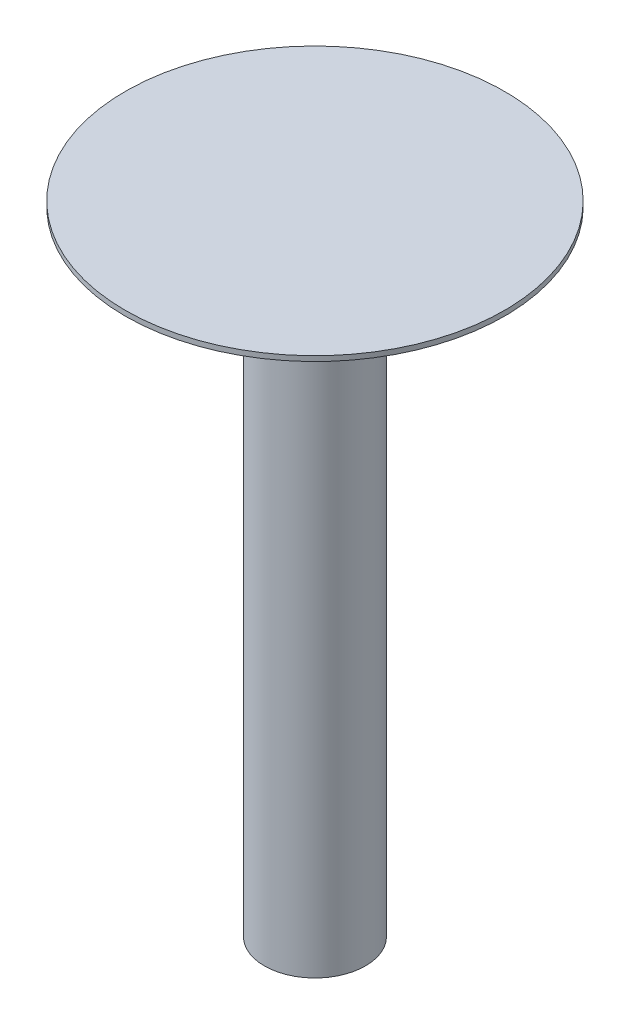
ISO-10303-21;
HEADER;
FILE_DESCRIPTION(('STEP AP214'),'2;1');
FILE_NAME('part.step','',(''),(''),'','','');
FILE_SCHEMA(('AUTOMOTIVE_DESIGN { 1 0 10303 214 1 1 1 1 }'));
ENDSEC;
DATA;
#1=APPLICATION_CONTEXT('core data for automotive mechanical design processes');
#2=APPLICATION_PROTOCOL_DEFINITION('international standard','automotive_design',2000,#1);
#3=PRODUCT_CONTEXT('',#1,'mechanical');
#4=PRODUCT('Part','Part','',(#3));
#5=PRODUCT_RELATED_PRODUCT_CATEGORY('part','',(#4));
#6=PRODUCT_DEFINITION_FORMATION('','',#4);
#7=PRODUCT_DEFINITION_CONTEXT('part definition',#1,'design');
#8=PRODUCT_DEFINITION('design','',#6,#7);
#9=PRODUCT_DEFINITION_SHAPE('','',#8);
#10=(LENGTH_UNIT() NAMED_UNIT(*) SI_UNIT(.MILLI.,.METRE.));
#11=(NAMED_UNIT(*) PLANE_ANGLE_UNIT() SI_UNIT($,.RADIAN.));
#12=(NAMED_UNIT(*) SI_UNIT($,.STERADIAN.) SOLID_ANGLE_UNIT());
#13=UNCERTAINTY_MEASURE_WITH_UNIT(LENGTH_MEASURE(1.E-05),#10,'distance_accuracy_value','');
#14=(GEOMETRIC_REPRESENTATION_CONTEXT(3) GLOBAL_UNCERTAINTY_ASSIGNED_CONTEXT((#13)) GLOBAL_UNIT_ASSIGNED_CONTEXT((#10,
#11,#12)) REPRESENTATION_CONTEXT('',''));
#15=CARTESIAN_POINT('',(0.,0.,0.));
#16=DIRECTION('',(0.,0.,1.));
#17=DIRECTION('',(1.,0.,0.));
#18=AXIS2_PLACEMENT_3D('',#15,#16,#17);
#19=CARTESIAN_POINT('',(0.,250.,0.));
#20=DIRECTION('',(0.,-1.,0.));
#21=DIRECTION('',(0.,0.,-1.));
#22=AXIS2_PLACEMENT_3D('',#19,#20,#21);
#23=CYLINDRICAL_SURFACE('',#22,20.);
#24=CARTESIAN_POINT('',(0.,250.,0.));
#25=DIRECTION('',(0.,1.,0.));
#26=DIRECTION('',(0.,0.,1.));
#27=AXIS2_PLACEMENT_3D('',#24,#25,#26);
#28=CIRCLE('',#27,20.);
#29=CARTESIAN_POINT('',(0.,250.,20.));
#30=VERTEX_POINT('',#29);
#31=EDGE_CURVE('E10',#30,#30,#28,.T.);
#32=ORIENTED_EDGE('',*,*,#31,.F.);
#33=EDGE_LOOP('',(#32));
#34=FACE_BOUND('',#33,.T.);
#35=CARTESIAN_POINT('',(0.,0.,0.));
#36=DIRECTION('',(0.,1.,0.));
#37=DIRECTION('',(0.,0.,1.));
#38=AXIS2_PLACEMENT_3D('',#35,#36,#37);
#39=CIRCLE('',#38,20.);
#40=CARTESIAN_POINT('',(0.,0.,20.));
#41=VERTEX_POINT('',#40);
#42=EDGE_CURVE('E32',#41,#41,#39,.T.);
#43=ORIENTED_EDGE('',*,*,#42,.T.);
#44=EDGE_LOOP('',(#43));
#45=FACE_BOUND('',#44,.T.);
#46=ADVANCED_FACE('F29',(#34,#45),#23,.T.);
#47=CARTESIAN_POINT('',(0.,0.,0.));
#48=DIRECTION('',(0.,1.,0.));
#49=DIRECTION('',(0.,0.,1.));
#50=AXIS2_PLACEMENT_3D('',#47,#48,#49);
#51=PLANE('',#50);
#52=ORIENTED_EDGE('',*,*,#42,.F.);
#53=EDGE_LOOP('',(#52));
#54=FACE_BOUND('',#53,.T.);
#55=ADVANCED_FACE('F57',(#54),#51,.F.);
#56=CARTESIAN_POINT('',(0.,250.,0.));
#57=DIRECTION('',(0.,1.,0.));
#58=DIRECTION('',(0.,0.,1.));
#59=AXIS2_PLACEMENT_3D('',#56,#57,#58);
#60=PLANE('',#59);
#61=CARTESIAN_POINT('',(0.,250.,0.));
#62=DIRECTION('',(0.,1.,0.));
#63=DIRECTION('',(0.,0.,1.));
#64=AXIS2_PLACEMENT_3D('',#61,#62,#63);
#65=CIRCLE('',#64,75.);
#66=CARTESIAN_POINT('',(0.,250.,75.));
#67=VERTEX_POINT('',#66);
#68=EDGE_CURVE('E41',#67,#67,#65,.T.);
#69=ORIENTED_EDGE('',*,*,#68,.F.);
#70=EDGE_LOOP('',(#69));
#71=FACE_BOUND('',#70,.T.);
#72=ORIENTED_EDGE('',*,*,#31,.T.);
#73=EDGE_LOOP('',(#72));
#74=FACE_BOUND('',#73,.T.);
#75=ADVANCED_FACE('F52',(#71,#74),#60,.F.);
#76=CARTESIAN_POINT('',(0.,252.,0.));
#77=DIRECTION('',(0.,-1.,0.));
#78=DIRECTION('',(0.,0.,-1.));
#79=AXIS2_PLACEMENT_3D('',#76,#77,#78);
#80=CYLINDRICAL_SURFACE('',#79,75.);
#81=CARTESIAN_POINT('',(0.,252.,0.));
#82=DIRECTION('',(0.,1.,0.));
#83=DIRECTION('',(0.,0.,1.));
#84=AXIS2_PLACEMENT_3D('',#81,#82,#83);
#85=CIRCLE('',#84,75.);
#86=CARTESIAN_POINT('',(0.,252.,75.));
#87=VERTEX_POINT('',#86);
#88=EDGE_CURVE('E39',#87,#87,#85,.T.);
#89=ORIENTED_EDGE('',*,*,#88,.F.);
#90=EDGE_LOOP('',(#89));
#91=FACE_BOUND('',#90,.T.);
#92=ORIENTED_EDGE('',*,*,#68,.T.);
#93=EDGE_LOOP('',(#92));
#94=FACE_BOUND('',#93,.T.);
#95=ADVANCED_FACE('F49',(#91,#94),#80,.T.);
#96=CARTESIAN_POINT('',(0.,252.,0.));
#97=DIRECTION('',(0.,1.,0.));
#98=DIRECTION('',(0.,0.,1.));
#99=AXIS2_PLACEMENT_3D('',#96,#97,#98);
#100=PLANE('',#99);
#101=ORIENTED_EDGE('',*,*,#88,.T.);
#102=EDGE_LOOP('',(#101));
#103=FACE_BOUND('',#102,.T.);
#104=ADVANCED_FACE('F47',(#103),#100,.T.);
#105=CLOSED_SHELL('',(#46,#55,#75,#95,#104));
#106=MANIFOLD_SOLID_BREP('B2',#105);
#107=ADVANCED_BREP_SHAPE_REPRESENTATION('',(#18,#106),#14);
#108=SHAPE_DEFINITION_REPRESENTATION(#9,#107);
ENDSEC;
END-ISO-10303-21;
